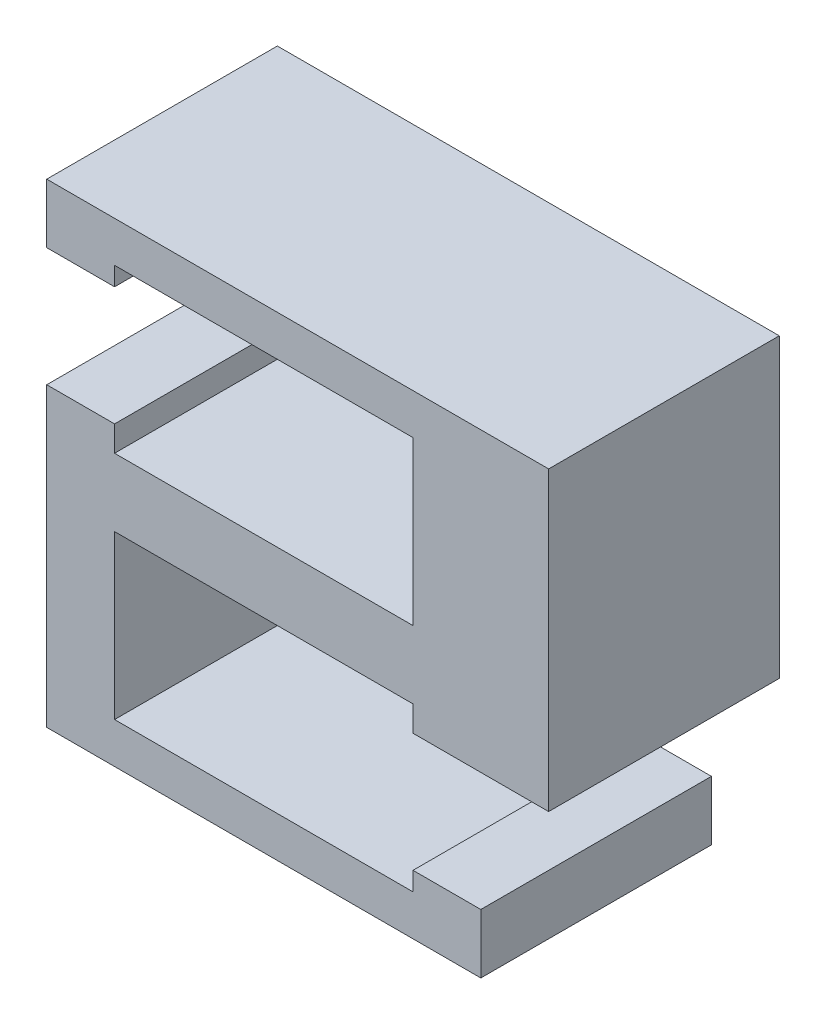
ISO-10303-21;
HEADER;
FILE_DESCRIPTION(('STEP AP214'),'2;1');
FILE_NAME('part.step','',(''),(''),'','','');
FILE_SCHEMA(('AUTOMOTIVE_DESIGN { 1 0 10303 214 1 1 1 1 }'));
ENDSEC;
DATA;
#1=APPLICATION_CONTEXT('core data for automotive mechanical design processes');
#2=APPLICATION_PROTOCOL_DEFINITION('international standard','automotive_design',2000,#1);
#3=PRODUCT_CONTEXT('',#1,'mechanical');
#4=PRODUCT('Part','Part','',(#3));
#5=PRODUCT_RELATED_PRODUCT_CATEGORY('part','',(#4));
#6=PRODUCT_DEFINITION_FORMATION('','',#4);
#7=PRODUCT_DEFINITION_CONTEXT('part definition',#1,'design');
#8=PRODUCT_DEFINITION('design','',#6,#7);
#9=PRODUCT_DEFINITION_SHAPE('','',#8);
#10=(LENGTH_UNIT() NAMED_UNIT(*) SI_UNIT(.MILLI.,.METRE.));
#11=(NAMED_UNIT(*) PLANE_ANGLE_UNIT() SI_UNIT($,.RADIAN.));
#12=(NAMED_UNIT(*) SI_UNIT($,.STERADIAN.) SOLID_ANGLE_UNIT());
#13=UNCERTAINTY_MEASURE_WITH_UNIT(LENGTH_MEASURE(1.E-05),#10,'distance_accuracy_value','');
#14=(GEOMETRIC_REPRESENTATION_CONTEXT(3) GLOBAL_UNCERTAINTY_ASSIGNED_CONTEXT((#13)) GLOBAL_UNIT_ASSIGNED_CONTEXT((#10,
#11,#12)) REPRESENTATION_CONTEXT('',''));
#15=CARTESIAN_POINT('',(0.,0.,0.));
#16=DIRECTION('',(0.,0.,1.));
#17=DIRECTION('',(1.,0.,0.));
#18=AXIS2_PLACEMENT_3D('',#15,#16,#17);
#19=CARTESIAN_POINT('',(16.1122382547684,0.,35.));
#20=DIRECTION('',(-1.,0.,0.));
#21=DIRECTION('',(0.,-1.,0.));
#22=AXIS2_PLACEMENT_3D('',#19,#20,#21);
#23=PLANE('',#22);
#24=DIRECTION('',(0.,0.,-1.));
#25=VECTOR('',#24,1.);
#26=CARTESIAN_POINT('',(16.1122382547684,40.9799365132959,35.));
#27=LINE('',#26,#25);
#28=CARTESIAN_POINT('',(16.1122382547684,40.9799365132959,32.));
#29=VERTEX_POINT('',#28);
#30=CARTESIAN_POINT('',(16.1122382547684,40.9799365132959,15.));
#31=VERTEX_POINT('',#30);
#32=EDGE_CURVE('E45',#29,#31,#27,.T.);
#33=ORIENTED_EDGE('',*,*,#32,.T.);
#34=DIRECTION('',(0.,1.,0.));
#35=VECTOR('',#34,1.);
#36=CARTESIAN_POINT('',(16.1122382547684,75.9799365132959,15.));
#37=LINE('',#36,#35);
#38=CARTESIAN_POINT('',(16.1122382547684,45.3549365132959,15.));
#39=VERTEX_POINT('',#38);
#40=EDGE_CURVE('E270',#31,#39,#37,.T.);
#41=ORIENTED_EDGE('',*,*,#40,.T.);
#42=DIRECTION('',(0.,0.,1.));
#43=VECTOR('',#42,1.);
#44=CARTESIAN_POINT('',(16.1122382547684,45.3549365132959,35.));
#45=LINE('',#44,#43);
#46=CARTESIAN_POINT('',(16.1122382547684,45.3549365132959,32.));
#47=VERTEX_POINT('',#46);
#48=EDGE_CURVE('E250',#39,#47,#45,.T.);
#49=ORIENTED_EDGE('',*,*,#48,.T.);
#50=DIRECTION('',(0.,1.,0.));
#51=VECTOR('',#50,1.);
#52=CARTESIAN_POINT('',(16.1122382547684,75.9799365132959,32.));
#53=LINE('',#52,#51);
#54=EDGE_CURVE('E208',#29,#47,#53,.T.);
#55=ORIENTED_EDGE('',*,*,#54,.F.);
#56=EDGE_LOOP('',(#33,#41,#49,#55));
#57=FACE_BOUND('',#56,.T.);
#58=ADVANCED_FACE('F37',(#57),#23,.F.);
#59=CARTESIAN_POINT('',(11.1122380163498,0.,35.));
#60=DIRECTION('',(-1.,0.,0.));
#61=DIRECTION('',(0.,0.,-1.));
#62=AXIS2_PLACEMENT_3D('',#59,#60,#61);
#63=PLANE('',#62);
#64=DIRECTION('',(0.,1.,0.));
#65=VECTOR('',#64,1.);
#66=CARTESIAN_POINT('',(11.1122380163498,0.,32.));
#67=LINE('',#66,#65);
#68=CARTESIAN_POINT('',(11.1122380163498,43.9799365132959,32.));
#69=VERTEX_POINT('',#68);
#70=CARTESIAN_POINT('',(11.1122380163498,45.3549365132959,32.));
#71=VERTEX_POINT('',#70);
#72=EDGE_CURVE('E217',#69,#71,#67,.T.);
#73=ORIENTED_EDGE('',*,*,#72,.T.);
#74=DIRECTION('',(0.,0.,1.));
#75=VECTOR('',#74,1.);
#76=CARTESIAN_POINT('',(11.1122380163498,45.3549365132959,35.));
#77=LINE('',#76,#75);
#78=CARTESIAN_POINT('',(11.1122380163498,45.3549365132959,15.));
#79=VERTEX_POINT('',#78);
#80=EDGE_CURVE('E251',#79,#71,#77,.T.);
#81=ORIENTED_EDGE('',*,*,#80,.F.);
#82=DIRECTION('',(0.,-1.,0.));
#83=VECTOR('',#82,1.);
#84=CARTESIAN_POINT('',(11.1122380163498,0.,15.));
#85=LINE('',#84,#83);
#86=CARTESIAN_POINT('',(11.1122380163498,43.9799365132959,15.));
#87=VERTEX_POINT('',#86);
#88=EDGE_CURVE('E286',#79,#87,#85,.T.);
#89=ORIENTED_EDGE('',*,*,#88,.T.);
#90=DIRECTION('',(0.,0.,-1.));
#91=VECTOR('',#90,1.);
#92=CARTESIAN_POINT('',(11.1122380163498,43.9799365132959,35.));
#93=LINE('',#92,#91);
#94=EDGE_CURVE('E327',#69,#87,#93,.T.);
#95=ORIENTED_EDGE('',*,*,#94,.F.);
#96=EDGE_LOOP('',(#73,#81,#89,#95));
#97=FACE_BOUND('',#96,.T.);
#98=ADVANCED_FACE('F353',(#97),#63,.T.);
#99=CARTESIAN_POINT('',(-10.8877619836502,0.,35.));
#100=DIRECTION('',(-1.,0.,0.));
#101=DIRECTION('',(0.,-1.,0.));
#102=AXIS2_PLACEMENT_3D('',#99,#100,#101);
#103=PLANE('',#102);
#104=DIRECTION('',(0.,0.,-1.));
#105=VECTOR('',#104,1.);
#106=CARTESIAN_POINT('',(-10.8877619836502,60.9799365132958,35.));
#107=LINE('',#106,#105);
#108=CARTESIAN_POINT('',(-10.8877619836502,60.9799365132958,32.));
#109=VERTEX_POINT('',#108);
#110=CARTESIAN_POINT('',(-10.8877619836502,60.9799365132959,15.));
#111=VERTEX_POINT('',#110);
#112=EDGE_CURVE('E316',#109,#111,#107,.T.);
#113=ORIENTED_EDGE('',*,*,#112,.T.);
#114=DIRECTION('',(0.,-1.,0.));
#115=VECTOR('',#114,1.);
#116=CARTESIAN_POINT('',(-10.8877619836502,0.,15.));
#117=LINE('',#116,#115);
#118=CARTESIAN_POINT('',(-10.8877619836502,62.8549365132958,15.));
#119=VERTEX_POINT('',#118);
#120=EDGE_CURVE('E304',#119,#111,#117,.T.);
#121=ORIENTED_EDGE('',*,*,#120,.F.);
#122=DIRECTION('',(0.,0.,-1.));
#123=VECTOR('',#122,1.);
#124=CARTESIAN_POINT('',(-10.8877619836502,62.8549365132958,15.));
#125=LINE('',#124,#123);
#126=CARTESIAN_POINT('',(-10.8877619836502,62.8549365132958,32.));
#127=VERTEX_POINT('',#126);
#128=EDGE_CURVE('E257',#127,#119,#125,.T.);
#129=ORIENTED_EDGE('',*,*,#128,.F.);
#130=DIRECTION('',(0.,1.,0.));
#131=VECTOR('',#130,1.);
#132=CARTESIAN_POINT('',(-10.8877619836502,0.,32.));
#133=LINE('',#132,#131);
#134=EDGE_CURVE('E235',#109,#127,#133,.T.);
#135=ORIENTED_EDGE('',*,*,#134,.F.);
#136=EDGE_LOOP('',(#113,#121,#129,#135));
#137=FACE_BOUND('',#136,.T.);
#138=ADVANCED_FACE('F376',(#137),#103,.F.);
#139=CARTESIAN_POINT('',(-15.8877622220688,0.,35.));
#140=DIRECTION('',(-1.,0.,0.));
#141=DIRECTION('',(0.,-1.,0.));
#142=AXIS2_PLACEMENT_3D('',#139,#140,#141);
#143=PLANE('',#142);
#144=DIRECTION('',(0.,1.,0.));
#145=VECTOR('',#144,1.);
#146=CARTESIAN_POINT('',(-15.8877622220688,75.9799365132959,32.));
#147=LINE('',#146,#145);
#148=CARTESIAN_POINT('',(-15.8877622220688,40.9799365132959,32.));
#149=VERTEX_POINT('',#148);
#150=CARTESIAN_POINT('',(-15.8877622220688,62.8549365132958,32.));
#151=VERTEX_POINT('',#150);
#152=EDGE_CURVE('E211',#149,#151,#147,.T.);
#153=ORIENTED_EDGE('',*,*,#152,.T.);
#154=DIRECTION('',(0.,0.,1.));
#155=VECTOR('',#154,1.);
#156=CARTESIAN_POINT('',(-15.8877622220688,62.8549365132958,15.));
#157=LINE('',#156,#155);
#158=CARTESIAN_POINT('',(-15.8877622220688,62.8549365132958,15.));
#159=VERTEX_POINT('',#158);
#160=EDGE_CURVE('E263',#159,#151,#157,.T.);
#161=ORIENTED_EDGE('',*,*,#160,.F.);
#162=DIRECTION('',(0.,1.,0.));
#163=VECTOR('',#162,1.);
#164=CARTESIAN_POINT('',(-15.8877622220688,75.9799365132959,15.));
#165=LINE('',#164,#163);
#166=CARTESIAN_POINT('',(-15.8877622220688,40.9799365132959,15.));
#167=VERTEX_POINT('',#166);
#168=EDGE_CURVE('E274',#167,#159,#165,.T.);
#169=ORIENTED_EDGE('',*,*,#168,.F.);
#170=DIRECTION('',(0.,0.,-1.));
#171=VECTOR('',#170,1.);
#172=CARTESIAN_POINT('',(-15.8877622220688,40.9799365132959,35.));
#173=LINE('',#172,#171);
#174=EDGE_CURVE('E311',#149,#167,#173,.T.);
#175=ORIENTED_EDGE('',*,*,#174,.F.);
#176=EDGE_LOOP('',(#153,#161,#169,#175));
#177=FACE_BOUND('',#176,.T.);
#178=ADVANCED_FACE('F366',(#177),#143,.T.);
#179=CARTESIAN_POINT('',(-15.8877622220688,75.9799365132959,15.));
#180=DIRECTION('',(0.,0.,1.));
#181=DIRECTION('',(0.,1.,0.));
#182=AXIS2_PLACEMENT_3D('',#179,#180,#181);
#183=PLANE('',#182);
#184=CARTESIAN_POINT('',(14.1122382547684,66.9799365132959,15.));
#185=DIRECTION('',(0.,0.,1.));
#186=DIRECTION('',(1.,0.,0.));
#187=AXIS2_PLACEMENT_3D('',#184,#185,#186);
#188=CIRCLE('',#187,0.999999999999961);
#189=CARTESIAN_POINT('',(15.1122382547684,66.9799365132959,15.));
#190=VERTEX_POINT('',#189);
#191=EDGE_CURVE('E198',#190,#190,#188,.T.);
#192=ORIENTED_EDGE('',*,*,#191,.T.);
#193=EDGE_LOOP('',(#192));
#194=FACE_BOUND('',#193,.T.);
#195=CARTESIAN_POINT('',(-13.8877622220688,49.9799365132959,15.));
#196=DIRECTION('',(0.,0.,1.));
#197=DIRECTION('',(1.,0.,0.));
#198=AXIS2_PLACEMENT_3D('',#195,#196,#197);
#199=CIRCLE('',#198,0.999999999999961);
#200=CARTESIAN_POINT('',(-12.8877622220688,49.9799365132959,15.));
#201=VERTEX_POINT('',#200);
#202=EDGE_CURVE('E201',#201,#201,#199,.T.);
#203=ORIENTED_EDGE('',*,*,#202,.T.);
#204=EDGE_LOOP('',(#203));
#205=FACE_BOUND('',#204,.T.);
#206=ORIENTED_EDGE('',*,*,#40,.F.);
#207=DIRECTION('',(1.,0.,0.));
#208=VECTOR('',#207,1.);
#209=CARTESIAN_POINT('',(-15.8877622220688,40.9799365132959,15.));
#210=LINE('',#209,#208);
#211=EDGE_CURVE('E280',#167,#31,#210,.T.);
#212=ORIENTED_EDGE('',*,*,#211,.F.);
#213=ORIENTED_EDGE('',*,*,#168,.T.);
#214=DIRECTION('',(-1.,0.,0.));
#215=VECTOR('',#214,1.);
#216=CARTESIAN_POINT('',(16.1132382547684,62.8549365132958,15.));
#217=LINE('',#216,#215);
#218=EDGE_CURVE('E266',#119,#159,#217,.T.);
#219=ORIENTED_EDGE('',*,*,#218,.F.);
#220=ORIENTED_EDGE('',*,*,#120,.T.);
#221=DIRECTION('',(1.,0.,0.));
#222=VECTOR('',#221,1.);
#223=CARTESIAN_POINT('',(0.,60.9799365132959,15.));
#224=LINE('',#223,#222);
#225=CARTESIAN_POINT('',(11.1122380163498,60.9799365132958,15.));
#226=VERTEX_POINT('',#225);
#227=EDGE_CURVE('E301',#111,#226,#224,.T.);
#228=ORIENTED_EDGE('',*,*,#227,.T.);
#229=DIRECTION('',(0.,-1.,0.));
#230=VECTOR('',#229,1.);
#231=CARTESIAN_POINT('',(11.1122380163498,0.,15.));
#232=LINE('',#231,#230);
#233=CARTESIAN_POINT('',(11.1122380163498,72.9799365132958,15.));
#234=VERTEX_POINT('',#233);
#235=EDGE_CURVE('E298',#234,#226,#232,.T.);
#236=ORIENTED_EDGE('',*,*,#235,.F.);
#237=DIRECTION('',(-1.,4.06395371900136E-09,0.));
#238=VECTOR('',#237,1.);
#239=CARTESIAN_POINT('',(2.96587084589218E-07,72.9799365584555,15.));
#240=LINE('',#239,#238);
#241=CARTESIAN_POINT('',(-10.8877619836502,72.9799366027028,15.));
#242=VERTEX_POINT('',#241);
#243=EDGE_CURVE('E295',#234,#242,#240,.T.);
#244=ORIENTED_EDGE('',*,*,#243,.T.);
#245=CARTESIAN_POINT('',(-10.8877619836502,71.6049365132959,15.));
#246=VERTEX_POINT('',#245);
#247=EDGE_CURVE('E305',#242,#246,#117,.T.);
#248=ORIENTED_EDGE('',*,*,#247,.T.);
#249=DIRECTION('',(-1.,0.,0.));
#250=VECTOR('',#249,1.);
#251=CARTESIAN_POINT('',(16.1132382547684,71.6049365132959,15.));
#252=LINE('',#251,#250);
#253=CARTESIAN_POINT('',(-15.8877622220688,71.6049365132959,15.));
#254=VERTEX_POINT('',#253);
#255=EDGE_CURVE('E262',#246,#254,#252,.T.);
#256=ORIENTED_EDGE('',*,*,#255,.T.);
#257=CARTESIAN_POINT('',(-15.8877622220688,75.9799365132959,15.));
#258=VERTEX_POINT('',#257);
#259=EDGE_CURVE('E277',#254,#258,#165,.T.);
#260=ORIENTED_EDGE('',*,*,#259,.T.);
#261=DIRECTION('',(1.,0.,0.));
#262=VECTOR('',#261,1.);
#263=CARTESIAN_POINT('',(-15.8877622220688,75.9799365132959,15.));
#264=LINE('',#263,#262);
#265=CARTESIAN_POINT('',(21.1122382547684,75.9799365132959,15.));
#266=VERTEX_POINT('',#265);
#267=EDGE_CURVE('E194',#258,#266,#264,.T.);
#268=ORIENTED_EDGE('',*,*,#267,.T.);
#269=DIRECTION('',(0.,-1.,0.));
#270=VECTOR('',#269,1.);
#271=CARTESIAN_POINT('',(21.1122382547684,75.9799365132959,15.));
#272=LINE('',#271,#270);
#273=CARTESIAN_POINT('',(21.1122382547684,54.1049365132959,15.));
#274=VERTEX_POINT('',#273);
#275=EDGE_CURVE('E178',#266,#274,#272,.T.);
#276=ORIENTED_EDGE('',*,*,#275,.T.);
#277=DIRECTION('',(1.,0.,0.));
#278=VECTOR('',#277,1.);
#279=CARTESIAN_POINT('',(-15.8887622220688,54.1049365132958,15.));
#280=LINE('',#279,#278);
#281=CARTESIAN_POINT('',(11.1122380163498,54.1049365132959,15.));
#282=VERTEX_POINT('',#281);
#283=EDGE_CURVE('E184',#282,#274,#280,.T.);
#284=ORIENTED_EDGE('',*,*,#283,.F.);
#285=CARTESIAN_POINT('',(11.1122380163498,55.9799365132959,15.));
#286=VERTEX_POINT('',#285);
#287=EDGE_CURVE('E287',#286,#282,#85,.T.);
#288=ORIENTED_EDGE('',*,*,#287,.F.);
#289=DIRECTION('',(-1.,0.,0.));
#290=VECTOR('',#289,1.);
#291=CARTESIAN_POINT('',(0.,55.9799365132959,15.));
#292=LINE('',#291,#290);
#293=CARTESIAN_POINT('',(-10.8877619836502,55.9799365132959,15.));
#294=VERTEX_POINT('',#293);
#295=EDGE_CURVE('E282',#286,#294,#292,.T.);
#296=ORIENTED_EDGE('',*,*,#295,.T.);
#297=DIRECTION('',(0.,-1.,0.));
#298=VECTOR('',#297,1.);
#299=CARTESIAN_POINT('',(-10.8877619836502,0.,15.));
#300=LINE('',#299,#298);
#301=CARTESIAN_POINT('',(-10.8877619836502,43.9799365132959,15.));
#302=VERTEX_POINT('',#301);
#303=EDGE_CURVE('E292',#294,#302,#300,.T.);
#304=ORIENTED_EDGE('',*,*,#303,.T.);
#305=DIRECTION('',(-1.,0.,0.));
#306=VECTOR('',#305,1.);
#307=CARTESIAN_POINT('',(0.,43.9799365132959,15.));
#308=LINE('',#307,#306);
#309=EDGE_CURVE('E289',#87,#302,#308,.T.);
#310=ORIENTED_EDGE('',*,*,#309,.F.);
#311=ORIENTED_EDGE('',*,*,#88,.F.);
#312=DIRECTION('',(1.,0.,0.));
#313=VECTOR('',#312,1.);
#314=CARTESIAN_POINT('',(-15.8887622220688,45.3549365132958,15.));
#315=LINE('',#314,#313);
#316=EDGE_CURVE('E188',#79,#39,#315,.T.);
#317=ORIENTED_EDGE('',*,*,#316,.T.);
#318=EDGE_LOOP('',(#206,#212,#213,#219,#220,#228,#236,#244,#248,#256,#260,#268,#276,#284,#288,
#296,#304,#310,#311,#317));
#319=FACE_BOUND('',#318,.T.);
#320=ADVANCED_FACE('F191',(#194,#205,#319),#183,.F.);
#321=CARTESIAN_POINT('',(0.,75.9799365132959,35.));
#322=DIRECTION('',(0.,1.,0.));
#323=DIRECTION('',(0.,0.,-1.));
#324=AXIS2_PLACEMENT_3D('',#321,#322,#323);
#325=PLANE('',#324);
#326=DIRECTION('',(-1.,0.,0.));
#327=VECTOR('',#326,1.);
#328=CARTESIAN_POINT('',(16.1122382547684,75.9799365132959,32.));
#329=LINE('',#328,#327);
#330=CARTESIAN_POINT('',(21.1122382547684,75.9799365132959,32.));
#331=VERTEX_POINT('',#330);
#332=CARTESIAN_POINT('',(-15.8877622220688,75.9799365132959,32.));
#333=VERTEX_POINT('',#332);
#334=EDGE_CURVE('E214',#331,#333,#329,.T.);
#335=ORIENTED_EDGE('',*,*,#334,.F.);
#336=DIRECTION('',(0.,0.,-1.));
#337=VECTOR('',#336,1.);
#338=CARTESIAN_POINT('',(21.1122382547684,75.9799365132959,15.));
#339=LINE('',#338,#337);
#340=EDGE_CURVE('E205',#331,#266,#339,.T.);
#341=ORIENTED_EDGE('',*,*,#340,.T.);
#342=ORIENTED_EDGE('',*,*,#267,.F.);
#343=DIRECTION('',(0.,0.,-1.));
#344=VECTOR('',#343,1.);
#345=CARTESIAN_POINT('',(-15.8877622220688,75.9799365132959,35.));
#346=LINE('',#345,#344);
#347=EDGE_CURVE('E314',#333,#258,#346,.T.);
#348=ORIENTED_EDGE('',*,*,#347,.F.);
#349=EDGE_LOOP('',(#335,#341,#342,#348));
#350=FACE_BOUND('',#349,.T.);
#351=ADVANCED_FACE('F402',(#350),#325,.T.);
#352=CARTESIAN_POINT('',(0.,40.9799365132959,35.));
#353=DIRECTION('',(0.,1.,0.));
#354=DIRECTION('',(0.,0.,-1.));
#355=AXIS2_PLACEMENT_3D('',#352,#353,#354);
#356=PLANE('',#355);
#357=ORIENTED_EDGE('',*,*,#174,.T.);
#358=ORIENTED_EDGE('',*,*,#211,.T.);
#359=ORIENTED_EDGE('',*,*,#32,.F.);
#360=DIRECTION('',(-1.,0.,0.));
#361=VECTOR('',#360,1.);
#362=CARTESIAN_POINT('',(16.1122382547684,40.9799365132959,32.));
#363=LINE('',#362,#361);
#364=EDGE_CURVE('E210',#29,#149,#363,.T.);
#365=ORIENTED_EDGE('',*,*,#364,.T.);
#366=EDGE_LOOP('',(#357,#358,#359,#365));
#367=FACE_BOUND('',#366,.T.);
#368=ADVANCED_FACE('F363',(#367),#356,.F.);
#369=DIRECTION('',(0.,0.,-1.));
#370=VECTOR('',#369,1.);
#371=CARTESIAN_POINT('',(-10.8877619836502,71.6049365132959,15.));
#372=LINE('',#371,#370);
#373=CARTESIAN_POINT('',(-10.8877619836502,71.6049365132959,32.));
#374=VERTEX_POINT('',#373);
#375=EDGE_CURVE('E261',#374,#246,#372,.T.);
#376=ORIENTED_EDGE('',*,*,#375,.T.);
#377=ORIENTED_EDGE('',*,*,#247,.F.);
#378=DIRECTION('',(0.,0.,-1.));
#379=VECTOR('',#378,1.);
#380=CARTESIAN_POINT('',(-10.8877619836502,72.9799366027028,35.));
#381=LINE('',#380,#379);
#382=CARTESIAN_POINT('',(-10.8877619836502,72.9799366027028,32.));
#383=VERTEX_POINT('',#382);
#384=EDGE_CURVE('E323',#383,#242,#381,.T.);
#385=ORIENTED_EDGE('',*,*,#384,.F.);
#386=DIRECTION('',(0.,1.,0.));
#387=VECTOR('',#386,1.);
#388=CARTESIAN_POINT('',(-10.8877619836502,0.,32.));
#389=LINE('',#388,#387);
#390=EDGE_CURVE('E245',#374,#383,#389,.T.);
#391=ORIENTED_EDGE('',*,*,#390,.F.);
#392=EDGE_LOOP('',(#376,#377,#385,#391));
#393=FACE_BOUND('',#392,.T.);
#394=ADVANCED_FACE('F391',(#393),#103,.F.);
#395=CARTESIAN_POINT('',(0.,60.9799365132959,35.));
#396=DIRECTION('',(0.,-1.,0.));
#397=DIRECTION('',(1.,0.,0.));
#398=AXIS2_PLACEMENT_3D('',#395,#396,#397);
#399=PLANE('',#398);
#400=DIRECTION('',(0.,0.,-1.));
#401=VECTOR('',#400,1.);
#402=CARTESIAN_POINT('',(11.1122380163498,60.9799365132958,35.));
#403=LINE('',#402,#401);
#404=CARTESIAN_POINT('',(11.1122380163498,60.9799365132958,32.));
#405=VERTEX_POINT('',#404);
#406=EDGE_CURVE('E319',#405,#226,#403,.T.);
#407=ORIENTED_EDGE('',*,*,#406,.T.);
#408=ORIENTED_EDGE('',*,*,#227,.F.);
#409=ORIENTED_EDGE('',*,*,#112,.F.);
#410=DIRECTION('',(-1.,0.,0.));
#411=VECTOR('',#410,1.);
#412=CARTESIAN_POINT('',(0.,60.9799365132959,32.));
#413=LINE('',#412,#411);
#414=EDGE_CURVE('E238',#405,#109,#413,.T.);
#415=ORIENTED_EDGE('',*,*,#414,.F.);
#416=EDGE_LOOP('',(#407,#408,#409,#415));
#417=FACE_BOUND('',#416,.T.);
#418=ADVANCED_FACE('F379',(#417),#399,.F.);
#419=DIRECTION('',(0.,1.,0.));
#420=VECTOR('',#419,1.);
#421=CARTESIAN_POINT('',(11.1122380163498,0.,32.));
#422=LINE('',#421,#420);
#423=CARTESIAN_POINT('',(11.1122380163498,72.9799365132958,32.));
#424=VERTEX_POINT('',#423);
#425=EDGE_CURVE('E240',#405,#424,#422,.T.);
#426=ORIENTED_EDGE('',*,*,#425,.T.);
#427=DIRECTION('',(0.,0.,-1.));
#428=VECTOR('',#427,1.);
#429=CARTESIAN_POINT('',(11.1122380163498,72.9799365132958,35.));
#430=LINE('',#429,#428);
#431=EDGE_CURVE('E321',#424,#234,#430,.T.);
#432=ORIENTED_EDGE('',*,*,#431,.T.);
#433=ORIENTED_EDGE('',*,*,#235,.T.);
#434=ORIENTED_EDGE('',*,*,#406,.F.);
#435=EDGE_LOOP('',(#426,#432,#433,#434));
#436=FACE_BOUND('',#435,.T.);
#437=ADVANCED_FACE('F382',(#436),#63,.T.);
#438=DIRECTION('',(0.,0.,-1.));
#439=VECTOR('',#438,1.);
#440=CARTESIAN_POINT('',(-10.8877619836502,43.9799365132959,35.));
#441=LINE('',#440,#439);
#442=CARTESIAN_POINT('',(-10.8877619836502,43.9799365132959,32.));
#443=VERTEX_POINT('',#442);
#444=EDGE_CURVE('E325',#443,#302,#441,.T.);
#445=ORIENTED_EDGE('',*,*,#444,.T.);
#446=ORIENTED_EDGE('',*,*,#303,.F.);
#447=DIRECTION('',(0.,0.,-1.));
#448=VECTOR('',#447,1.);
#449=CARTESIAN_POINT('',(-10.8877619836502,55.9799365132959,35.));
#450=LINE('',#449,#448);
#451=CARTESIAN_POINT('',(-10.8877619836502,55.9799365132959,32.));
#452=VERTEX_POINT('',#451);
#453=EDGE_CURVE('E308',#452,#294,#450,.T.);
#454=ORIENTED_EDGE('',*,*,#453,.F.);
#455=DIRECTION('',(0.,1.,0.));
#456=VECTOR('',#455,1.);
#457=CARTESIAN_POINT('',(-10.8877619836502,0.,32.));
#458=LINE('',#457,#456);
#459=EDGE_CURVE('E223',#443,#452,#458,.T.);
#460=ORIENTED_EDGE('',*,*,#459,.F.);
#461=EDGE_LOOP('',(#445,#446,#454,#460));
#462=FACE_BOUND('',#461,.T.);
#463=ADVANCED_FACE('F338',(#462),#103,.F.);
#464=CARTESIAN_POINT('',(0.,43.9799365132959,35.));
#465=DIRECTION('',(0.,1.,0.));
#466=DIRECTION('',(0.,0.,-1.));
#467=AXIS2_PLACEMENT_3D('',#464,#465,#466);
#468=PLANE('',#467);
#469=DIRECTION('',(1.,0.,0.));
#470=VECTOR('',#469,1.);
#471=CARTESIAN_POINT('',(0.,43.9799365132959,32.));
#472=LINE('',#471,#470);
#473=EDGE_CURVE('E221',#443,#69,#472,.T.);
#474=ORIENTED_EDGE('',*,*,#473,.T.);
#475=ORIENTED_EDGE('',*,*,#94,.T.);
#476=ORIENTED_EDGE('',*,*,#309,.T.);
#477=ORIENTED_EDGE('',*,*,#444,.F.);
#478=EDGE_LOOP('',(#474,#475,#476,#477));
#479=FACE_BOUND('',#478,.T.);
#480=ADVANCED_FACE('F346',(#479),#468,.T.);
#481=DIRECTION('',(0.,1.,0.));
#482=VECTOR('',#481,1.);
#483=CARTESIAN_POINT('',(11.1122380163498,0.,32.));
#484=LINE('',#483,#482);
#485=CARTESIAN_POINT('',(11.1122380163498,54.1049365132959,32.));
#486=VERTEX_POINT('',#485);
#487=CARTESIAN_POINT('',(11.1122380163498,55.9799365132959,32.));
#488=VERTEX_POINT('',#487);
#489=EDGE_CURVE('E228',#486,#488,#484,.T.);
#490=ORIENTED_EDGE('',*,*,#489,.T.);
#491=DIRECTION('',(0.,0.,-1.));
#492=VECTOR('',#491,1.);
#493=CARTESIAN_POINT('',(11.1122380163498,55.9799365132959,35.));
#494=LINE('',#493,#492);
#495=EDGE_CURVE('E330',#488,#286,#494,.T.);
#496=ORIENTED_EDGE('',*,*,#495,.T.);
#497=ORIENTED_EDGE('',*,*,#287,.T.);
#498=DIRECTION('',(0.,0.,-1.));
#499=VECTOR('',#498,1.);
#500=CARTESIAN_POINT('',(11.1122380163498,54.1049365132959,35.));
#501=LINE('',#500,#499);
#502=EDGE_CURVE('E58',#486,#282,#501,.T.);
#503=ORIENTED_EDGE('',*,*,#502,.F.);
#504=EDGE_LOOP('',(#490,#496,#497,#503));
#505=FACE_BOUND('',#504,.T.);
#506=ADVANCED_FACE('F341',(#505),#63,.T.);
#507=CARTESIAN_POINT('',(2.96587084589218E-07,72.9799365584555,35.));
#508=DIRECTION('',(4.06395371900136E-09,1.,0.));
#509=DIRECTION('',(-1.,4.06395371900136E-09,0.));
#510=AXIS2_PLACEMENT_3D('',#507,#508,#509);
#511=PLANE('',#510);
#512=ORIENTED_EDGE('',*,*,#384,.T.);
#513=ORIENTED_EDGE('',*,*,#243,.F.);
#514=ORIENTED_EDGE('',*,*,#431,.F.);
#515=DIRECTION('',(1.,-4.06395371900136E-09,0.));
#516=VECTOR('',#515,1.);
#517=CARTESIAN_POINT('',(2.96587084589218E-07,72.9799365584555,32.));
#518=LINE('',#517,#516);
#519=EDGE_CURVE('E243',#383,#424,#518,.T.);
#520=ORIENTED_EDGE('',*,*,#519,.F.);
#521=EDGE_LOOP('',(#512,#513,#514,#520));
#522=FACE_BOUND('',#521,.T.);
#523=ADVANCED_FACE('F387',(#522),#511,.F.);
#524=CARTESIAN_POINT('',(0.,55.9799365132959,35.));
#525=DIRECTION('',(0.,1.,0.));
#526=DIRECTION('',(0.,0.,-1.));
#527=AXIS2_PLACEMENT_3D('',#524,#525,#526);
#528=PLANE('',#527);
#529=ORIENTED_EDGE('',*,*,#453,.T.);
#530=ORIENTED_EDGE('',*,*,#295,.F.);
#531=ORIENTED_EDGE('',*,*,#495,.F.);
#532=DIRECTION('',(1.,0.,0.));
#533=VECTOR('',#532,1.);
#534=CARTESIAN_POINT('',(0.,55.9799365132959,32.));
#535=LINE('',#534,#533);
#536=EDGE_CURVE('E226',#452,#488,#535,.T.);
#537=ORIENTED_EDGE('',*,*,#536,.F.);
#538=EDGE_LOOP('',(#529,#530,#531,#537));
#539=FACE_BOUND('',#538,.T.);
#540=ADVANCED_FACE('F39',(#539),#528,.F.);
#541=CARTESIAN_POINT('',(-15.8877622220688,71.6049365132959,32.));
#542=VERTEX_POINT('',#541);
#543=EDGE_CURVE('E207',#542,#333,#147,.T.);
#544=ORIENTED_EDGE('',*,*,#543,.T.);
#545=ORIENTED_EDGE('',*,*,#347,.T.);
#546=ORIENTED_EDGE('',*,*,#259,.F.);
#547=DIRECTION('',(0.,0.,1.));
#548=VECTOR('',#547,1.);
#549=CARTESIAN_POINT('',(-15.8877622220688,71.6049365132959,15.));
#550=LINE('',#549,#548);
#551=EDGE_CURVE('E258',#254,#542,#550,.T.);
#552=ORIENTED_EDGE('',*,*,#551,.T.);
#553=EDGE_LOOP('',(#544,#545,#546,#552));
#554=FACE_BOUND('',#553,.T.);
#555=ADVANCED_FACE('F398',(#554),#143,.T.);
#556=CARTESIAN_POINT('',(16.1132382547684,71.6049365132959,15.));
#557=DIRECTION('',(0.,1.,0.));
#558=DIRECTION('',(-1.,0.,0.));
#559=AXIS2_PLACEMENT_3D('',#556,#557,#558);
#560=PLANE('',#559);
#561=ORIENTED_EDGE('',*,*,#551,.F.);
#562=ORIENTED_EDGE('',*,*,#255,.F.);
#563=ORIENTED_EDGE('',*,*,#375,.F.);
#564=DIRECTION('',(1.,0.,0.));
#565=VECTOR('',#564,1.);
#566=CARTESIAN_POINT('',(16.1132382547684,71.6049365132959,32.));
#567=LINE('',#566,#565);
#568=EDGE_CURVE('E248',#542,#374,#567,.T.);
#569=ORIENTED_EDGE('',*,*,#568,.F.);
#570=EDGE_LOOP('',(#561,#562,#563,#569));
#571=FACE_BOUND('',#570,.T.);
#572=ADVANCED_FACE('F395',(#571),#560,.F.);
#573=CARTESIAN_POINT('',(16.1132382547684,62.8549365132958,15.));
#574=DIRECTION('',(0.,1.,0.));
#575=DIRECTION('',(-1.,0.,0.));
#576=AXIS2_PLACEMENT_3D('',#573,#574,#575);
#577=PLANE('',#576);
#578=DIRECTION('',(1.,0.,0.));
#579=VECTOR('',#578,1.);
#580=CARTESIAN_POINT('',(16.1132382547684,62.8549365132958,32.));
#581=LINE('',#580,#579);
#582=EDGE_CURVE('E233',#151,#127,#581,.T.);
#583=ORIENTED_EDGE('',*,*,#582,.T.);
#584=ORIENTED_EDGE('',*,*,#128,.T.);
#585=ORIENTED_EDGE('',*,*,#218,.T.);
#586=ORIENTED_EDGE('',*,*,#160,.T.);
#587=EDGE_LOOP('',(#583,#584,#585,#586));
#588=FACE_BOUND('',#587,.T.);
#589=ADVANCED_FACE('F368',(#588),#577,.T.);
#590=CARTESIAN_POINT('',(-15.8887622220688,54.1049365132958,35.));
#591=DIRECTION('',(0.,1.,0.));
#592=DIRECTION('',(-1.,0.,0.));
#593=AXIS2_PLACEMENT_3D('',#590,#591,#592);
#594=PLANE('',#593);
#595=ORIENTED_EDGE('',*,*,#502,.T.);
#596=ORIENTED_EDGE('',*,*,#283,.T.);
#597=DIRECTION('',(0.,0.,1.));
#598=VECTOR('',#597,1.);
#599=CARTESIAN_POINT('',(21.1122382547684,54.1049365132959,15.));
#600=LINE('',#599,#598);
#601=CARTESIAN_POINT('',(21.1122382547684,54.1049365132959,32.));
#602=VERTEX_POINT('',#601);
#603=EDGE_CURVE('E174',#274,#602,#600,.T.);
#604=ORIENTED_EDGE('',*,*,#603,.T.);
#605=DIRECTION('',(1.,0.,0.));
#606=VECTOR('',#605,1.);
#607=CARTESIAN_POINT('',(-15.8887622220688,54.1049365132958,32.));
#608=LINE('',#607,#606);
#609=EDGE_CURVE('E231',#486,#602,#608,.T.);
#610=ORIENTED_EDGE('',*,*,#609,.F.);
#611=EDGE_LOOP('',(#595,#596,#604,#610));
#612=FACE_BOUND('',#611,.T.);
#613=ADVANCED_FACE('F185',(#612),#594,.F.);
#614=CARTESIAN_POINT('',(-15.8887622220688,45.3549365132958,35.));
#615=DIRECTION('',(0.,-1.,0.));
#616=DIRECTION('',(1.,0.,0.));
#617=AXIS2_PLACEMENT_3D('',#614,#615,#616);
#618=PLANE('',#617);
#619=ORIENTED_EDGE('',*,*,#48,.F.);
#620=ORIENTED_EDGE('',*,*,#316,.F.);
#621=ORIENTED_EDGE('',*,*,#80,.T.);
#622=DIRECTION('',(-1.,0.,0.));
#623=VECTOR('',#622,1.);
#624=CARTESIAN_POINT('',(-15.8887622220688,45.3549365132958,32.));
#625=LINE('',#624,#623);
#626=EDGE_CURVE('E11',#47,#71,#625,.T.);
#627=ORIENTED_EDGE('',*,*,#626,.F.);
#628=EDGE_LOOP('',(#619,#620,#621,#627));
#629=FACE_BOUND('',#628,.T.);
#630=ADVANCED_FACE('F355',(#629),#618,.F.);
#631=CARTESIAN_POINT('',(16.1122382547684,75.9799365132959,32.));
#632=DIRECTION('',(0.,0.,-1.));
#633=DIRECTION('',(0.,-1.,0.));
#634=AXIS2_PLACEMENT_3D('',#631,#632,#633);
#635=PLANE('',#634);
#636=ORIENTED_EDGE('',*,*,#543,.F.);
#637=ORIENTED_EDGE('',*,*,#568,.T.);
#638=ORIENTED_EDGE('',*,*,#390,.T.);
#639=ORIENTED_EDGE('',*,*,#519,.T.);
#640=ORIENTED_EDGE('',*,*,#425,.F.);
#641=ORIENTED_EDGE('',*,*,#414,.T.);
#642=ORIENTED_EDGE('',*,*,#134,.T.);
#643=ORIENTED_EDGE('',*,*,#582,.F.);
#644=ORIENTED_EDGE('',*,*,#152,.F.);
#645=ORIENTED_EDGE('',*,*,#364,.F.);
#646=ORIENTED_EDGE('',*,*,#54,.T.);
#647=ORIENTED_EDGE('',*,*,#626,.T.);
#648=ORIENTED_EDGE('',*,*,#72,.F.);
#649=ORIENTED_EDGE('',*,*,#473,.F.);
#650=ORIENTED_EDGE('',*,*,#459,.T.);
#651=ORIENTED_EDGE('',*,*,#536,.T.);
#652=ORIENTED_EDGE('',*,*,#489,.F.);
#653=ORIENTED_EDGE('',*,*,#609,.T.);
#654=DIRECTION('',(0.,1.,0.));
#655=VECTOR('',#654,1.);
#656=CARTESIAN_POINT('',(21.1122382547684,75.9799365132959,32.));
#657=LINE('',#656,#655);
#658=EDGE_CURVE('E180',#602,#331,#657,.T.);
#659=ORIENTED_EDGE('',*,*,#658,.T.);
#660=ORIENTED_EDGE('',*,*,#334,.T.);
#661=EDGE_LOOP('',(#636,#637,#638,#639,#640,#641,#642,#643,#644,#645,#646,#647,#648,#649,#650,
#651,#652,#653,#659,#660));
#662=FACE_BOUND('',#661,.T.);
#663=ADVANCED_FACE('F344',(#662),#635,.F.);
#664=CARTESIAN_POINT('',(21.1122382547684,0.,0.));
#665=DIRECTION('',(1.,0.,0.));
#666=DIRECTION('',(0.,1.,0.));
#667=AXIS2_PLACEMENT_3D('',#664,#665,#666);
#668=PLANE('',#667);
#669=ORIENTED_EDGE('',*,*,#275,.F.);
#670=ORIENTED_EDGE('',*,*,#340,.F.);
#671=ORIENTED_EDGE('',*,*,#658,.F.);
#672=ORIENTED_EDGE('',*,*,#603,.F.);
#673=EDGE_LOOP('',(#669,#670,#671,#672));
#674=FACE_BOUND('',#673,.T.);
#675=ADVANCED_FACE('F175',(#674),#668,.T.);
#676=CARTESIAN_POINT('',(-13.8877622220688,49.9799365132959,25.));
#677=DIRECTION('',(0.,0.,-1.));
#678=DIRECTION('',(1.,0.,0.));
#679=AXIS2_PLACEMENT_3D('',#676,#677,#678);
#680=CYLINDRICAL_SURFACE('',#679,0.999999999999961);
#681=CARTESIAN_POINT('',(-13.8877622220688,49.9799365132959,25.));
#682=DIRECTION('',(0.,0.,1.));
#683=DIRECTION('',(1.,0.,0.));
#684=AXIS2_PLACEMENT_3D('',#681,#682,#683);
#685=CIRCLE('',#684,0.999999999999961);
#686=CARTESIAN_POINT('',(-12.8877622220688,49.9799365132959,25.));
#687=VERTEX_POINT('',#686);
#688=EDGE_CURVE('E628',#687,#687,#685,.T.);
#689=ORIENTED_EDGE('',*,*,#688,.T.);
#690=EDGE_LOOP('',(#689));
#691=FACE_BOUND('',#690,.T.);
#692=ORIENTED_EDGE('',*,*,#202,.F.);
#693=EDGE_LOOP('',(#692));
#694=FACE_BOUND('',#693,.T.);
#695=ADVANCED_FACE('F577',(#691,#694),#680,.F.);
#696=CARTESIAN_POINT('',(-13.8877622220688,49.9799365132959,25.));
#697=DIRECTION('',(0.,0.,-1.));
#698=DIRECTION('',(1.,0.,0.));
#699=AXIS2_PLACEMENT_3D('',#696,#697,#698);
#700=PLANE('',#699);
#701=ORIENTED_EDGE('',*,*,#688,.F.);
#702=EDGE_LOOP('',(#701));
#703=FACE_BOUND('',#702,.T.);
#704=ADVANCED_FACE('F585',(#703),#700,.T.);
#705=CARTESIAN_POINT('',(14.1122382547684,66.9799365132959,25.));
#706=DIRECTION('',(0.,0.,-1.));
#707=DIRECTION('',(1.,0.,0.));
#708=AXIS2_PLACEMENT_3D('',#705,#706,#707);
#709=CYLINDRICAL_SURFACE('',#708,0.999999999999961);
#710=CARTESIAN_POINT('',(14.1122382547684,66.9799365132959,25.));
#711=DIRECTION('',(0.,0.,1.));
#712=DIRECTION('',(1.,0.,0.));
#713=AXIS2_PLACEMENT_3D('',#710,#711,#712);
#714=CIRCLE('',#713,0.999999999999961);
#715=CARTESIAN_POINT('',(15.1122382547684,66.9799365132959,25.));
#716=VERTEX_POINT('',#715);
#717=EDGE_CURVE('E195',#716,#716,#714,.T.);
#718=ORIENTED_EDGE('',*,*,#717,.T.);
#719=EDGE_LOOP('',(#718));
#720=FACE_BOUND('',#719,.T.);
#721=ORIENTED_EDGE('',*,*,#191,.F.);
#722=EDGE_LOOP('',(#721));
#723=FACE_BOUND('',#722,.T.);
#724=ADVANCED_FACE('F594',(#720,#723),#709,.F.);
#725=CARTESIAN_POINT('',(14.1122382547684,66.9799365132959,25.));
#726=DIRECTION('',(0.,0.,-1.));
#727=DIRECTION('',(1.,0.,0.));
#728=AXIS2_PLACEMENT_3D('',#725,#726,#727);
#729=PLANE('',#728);
#730=ORIENTED_EDGE('',*,*,#717,.F.);
#731=EDGE_LOOP('',(#730));
#732=FACE_BOUND('',#731,.T.);
#733=ADVANCED_FACE('F603',(#732),#729,.T.);
#734=CLOSED_SHELL('',(#58,#98,#138,#178,#320,#351,#368,#394,#418,#437,#463,#480,#506,#523,#540,
#555,#572,#589,#613,#630,#663,#675,#695,#704,#724,#733));
#735=MANIFOLD_SOLID_BREP('B2',#734);
#736=ADVANCED_BREP_SHAPE_REPRESENTATION('',(#18,#735),#14);
#737=SHAPE_DEFINITION_REPRESENTATION(#9,#736);
ENDSEC;
END-ISO-10303-21;
